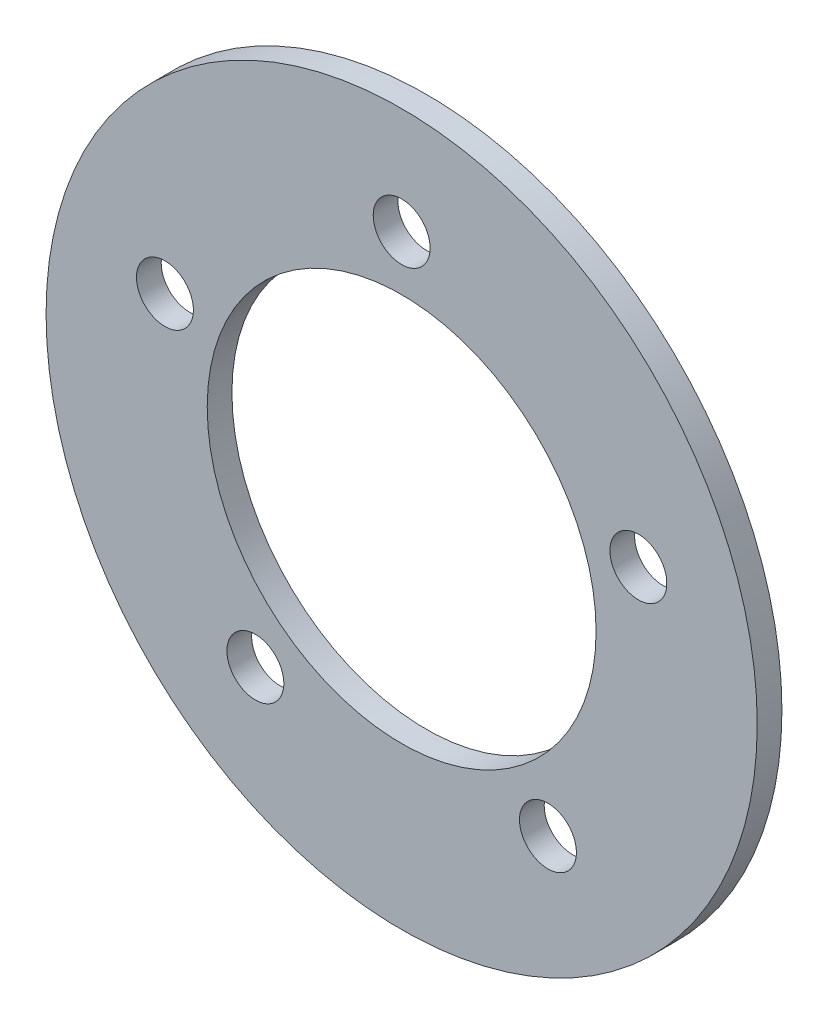
ISO-10303-21;
HEADER;
FILE_DESCRIPTION(('STEP AP214'),'2;1');
FILE_NAME('part.step','',(''),(''),'','','');
FILE_SCHEMA(('AUTOMOTIVE_DESIGN { 1 0 10303 214 1 1 1 1 }'));
ENDSEC;
DATA;
#1=APPLICATION_CONTEXT('core data for automotive mechanical design processes');
#2=APPLICATION_PROTOCOL_DEFINITION('international standard','automotive_design',2000,#1);
#3=PRODUCT_CONTEXT('',#1,'mechanical');
#4=PRODUCT('Part','Part','',(#3));
#5=PRODUCT_RELATED_PRODUCT_CATEGORY('part','',(#4));
#6=PRODUCT_DEFINITION_FORMATION('','',#4);
#7=PRODUCT_DEFINITION_CONTEXT('part definition',#1,'design');
#8=PRODUCT_DEFINITION('design','',#6,#7);
#9=PRODUCT_DEFINITION_SHAPE('','',#8);
#10=(LENGTH_UNIT() NAMED_UNIT(*) SI_UNIT(.MILLI.,.METRE.));
#11=(NAMED_UNIT(*) PLANE_ANGLE_UNIT() SI_UNIT($,.RADIAN.));
#12=(NAMED_UNIT(*) SI_UNIT($,.STERADIAN.) SOLID_ANGLE_UNIT());
#13=UNCERTAINTY_MEASURE_WITH_UNIT(LENGTH_MEASURE(1.E-05),#10,'distance_accuracy_value','');
#14=(GEOMETRIC_REPRESENTATION_CONTEXT(3) GLOBAL_UNCERTAINTY_ASSIGNED_CONTEXT((#13)) GLOBAL_UNIT_ASSIGNED_CONTEXT((#10,
#11,#12)) REPRESENTATION_CONTEXT('',''));
#15=CARTESIAN_POINT('',(0.,0.,0.));
#16=DIRECTION('',(0.,0.,1.));
#17=DIRECTION('',(1.,0.,0.));
#18=AXIS2_PLACEMENT_3D('',#15,#16,#17);
#19=CARTESIAN_POINT('',(0.,0.,-14.2875));
#20=DIRECTION('',(0.,0.,-1.));
#21=DIRECTION('',(-1.,0.,0.));
#22=AXIS2_PLACEMENT_3D('',#19,#20,#21);
#23=PLANE('',#22);
#24=CARTESIAN_POINT('',(15.2169042607224,4.94427190999933,-14.2875));
#25=DIRECTION('',(0.,0.,-1.));
#26=DIRECTION('',(-1.,0.,0.));
#27=AXIS2_PLACEMENT_3D('',#24,#25,#26);
#28=CIRCLE('',#27,1.8288);
#29=CARTESIAN_POINT('',(13.3881042607224,4.94427190999933,-14.2875));
#30=VERTEX_POINT('',#29);
#31=EDGE_CURVE('E86',#30,#30,#28,.T.);
#32=ORIENTED_EDGE('',*,*,#31,.F.);
#33=EDGE_LOOP('',(#32));
#34=FACE_BOUND('',#33,.T.);
#35=CARTESIAN_POINT('',(-9.4045640366795,-12.9442719099992,-14.2875));
#36=DIRECTION('',(0.,0.,-1.));
#37=DIRECTION('',(-1.,0.,0.));
#38=AXIS2_PLACEMENT_3D('',#35,#36,#37);
#39=CIRCLE('',#38,1.8288);
#40=CARTESIAN_POINT('',(-11.2333640366795,-12.9442719099992,-14.2875));
#41=VERTEX_POINT('',#40);
#42=EDGE_CURVE('E70',#41,#41,#39,.T.);
#43=ORIENTED_EDGE('',*,*,#42,.F.);
#44=EDGE_LOOP('',(#43));
#45=FACE_BOUND('',#44,.T.);
#46=CARTESIAN_POINT('',(0.,0.,-14.2875));
#47=DIRECTION('',(0.,0.,-1.));
#48=DIRECTION('',(-1.,0.,0.));
#49=AXIS2_PLACEMENT_3D('',#46,#47,#48);
#50=CIRCLE('',#49,12.5);
#51=CARTESIAN_POINT('',(-12.5,0.,-14.2875));
#52=VERTEX_POINT('',#51);
#53=EDGE_CURVE('E56',#52,#52,#50,.T.);
#54=ORIENTED_EDGE('',*,*,#53,.F.);
#55=EDGE_LOOP('',(#54));
#56=FACE_BOUND('',#55,.T.);
#57=CARTESIAN_POINT('',(0.,0.,-14.2875));
#58=DIRECTION('',(0.,0.,-1.));
#59=DIRECTION('',(-1.,0.,0.));
#60=AXIS2_PLACEMENT_3D('',#57,#58,#59);
#61=CIRCLE('',#60,22.86);
#62=CARTESIAN_POINT('',(-22.86,0.,-14.2875));
#63=VERTEX_POINT('',#62);
#64=EDGE_CURVE('E10',#63,#63,#61,.T.);
#65=ORIENTED_EDGE('',*,*,#64,.T.);
#66=EDGE_LOOP('',(#65));
#67=FACE_BOUND('',#66,.T.);
#68=CARTESIAN_POINT('',(-15.2169042607225,4.94427190999912,-14.2875));
#69=DIRECTION('',(0.,0.,-1.));
#70=DIRECTION('',(-1.,0.,0.));
#71=AXIS2_PLACEMENT_3D('',#68,#69,#70);
#72=CIRCLE('',#71,1.8288);
#73=CARTESIAN_POINT('',(-17.0457042607225,4.94427190999912,-14.2875));
#74=VERTEX_POINT('',#73);
#75=EDGE_CURVE('E62',#74,#74,#72,.T.);
#76=ORIENTED_EDGE('',*,*,#75,.F.);
#77=EDGE_LOOP('',(#76));
#78=FACE_BOUND('',#77,.T.);
#79=CARTESIAN_POINT('',(9.40456403667968,-12.9442719099991,-14.2875));
#80=DIRECTION('',(0.,0.,-1.));
#81=DIRECTION('',(-1.,0.,0.));
#82=AXIS2_PLACEMENT_3D('',#79,#80,#81);
#83=CIRCLE('',#82,1.8288);
#84=CARTESIAN_POINT('',(7.57576403667969,-12.9442719099991,-14.2875));
#85=VERTEX_POINT('',#84);
#86=EDGE_CURVE('E78',#85,#85,#83,.T.);
#87=ORIENTED_EDGE('',*,*,#86,.F.);
#88=EDGE_LOOP('',(#87));
#89=FACE_BOUND('',#88,.T.);
#90=CARTESIAN_POINT('',(0.,16.,-14.2875));
#91=DIRECTION('',(0.,0.,-1.));
#92=DIRECTION('',(-1.,0.,0.));
#93=AXIS2_PLACEMENT_3D('',#90,#91,#92);
#94=CIRCLE('',#93,1.8288);
#95=CARTESIAN_POINT('',(-1.8288,16.,-14.2875));
#96=VERTEX_POINT('',#95);
#97=EDGE_CURVE('E94',#96,#96,#94,.T.);
#98=ORIENTED_EDGE('',*,*,#97,.F.);
#99=EDGE_LOOP('',(#98));
#100=FACE_BOUND('',#99,.T.);
#101=ADVANCED_FACE('F43',(#34,#45,#56,#67,#78,#89,#100),#23,.T.);
#102=CARTESIAN_POINT('',(0.,0.,-12.7));
#103=DIRECTION('',(0.,0.,-1.));
#104=DIRECTION('',(-1.,0.,0.));
#105=AXIS2_PLACEMENT_3D('',#102,#103,#104);
#106=PLANE('',#105);
#107=CARTESIAN_POINT('',(0.,0.,-12.7));
#108=DIRECTION('',(0.,0.,-1.));
#109=DIRECTION('',(-1.,0.,0.));
#110=AXIS2_PLACEMENT_3D('',#107,#108,#109);
#111=CIRCLE('',#110,22.86);
#112=CARTESIAN_POINT('',(-22.86,0.,-12.7));
#113=VERTEX_POINT('',#112);
#114=EDGE_CURVE('E47',#113,#113,#111,.T.);
#115=ORIENTED_EDGE('',*,*,#114,.F.);
#116=EDGE_LOOP('',(#115));
#117=FACE_BOUND('',#116,.T.);
#118=CARTESIAN_POINT('',(0.,0.,-12.7));
#119=DIRECTION('',(0.,0.,-1.));
#120=DIRECTION('',(-1.,0.,0.));
#121=AXIS2_PLACEMENT_3D('',#118,#119,#120);
#122=CIRCLE('',#121,12.5);
#123=CARTESIAN_POINT('',(-12.5,0.,-12.7));
#124=VERTEX_POINT('',#123);
#125=EDGE_CURVE('E58',#124,#124,#122,.T.);
#126=ORIENTED_EDGE('',*,*,#125,.T.);
#127=EDGE_LOOP('',(#126));
#128=FACE_BOUND('',#127,.T.);
#129=CARTESIAN_POINT('',(-15.2169042607225,4.94427190999912,-12.7));
#130=DIRECTION('',(0.,0.,-1.));
#131=DIRECTION('',(-1.,0.,0.));
#132=AXIS2_PLACEMENT_3D('',#129,#130,#131);
#133=CIRCLE('',#132,1.8288);
#134=CARTESIAN_POINT('',(-17.0457042607225,4.94427190999912,-12.7));
#135=VERTEX_POINT('',#134);
#136=EDGE_CURVE('E66',#135,#135,#133,.T.);
#137=ORIENTED_EDGE('',*,*,#136,.T.);
#138=EDGE_LOOP('',(#137));
#139=FACE_BOUND('',#138,.T.);
#140=CARTESIAN_POINT('',(-9.4045640366795,-12.9442719099992,-12.7));
#141=DIRECTION('',(0.,0.,-1.));
#142=DIRECTION('',(-1.,0.,0.));
#143=AXIS2_PLACEMENT_3D('',#140,#141,#142);
#144=CIRCLE('',#143,1.8288);
#145=CARTESIAN_POINT('',(-11.2333640366795,-12.9442719099992,-12.7));
#146=VERTEX_POINT('',#145);
#147=EDGE_CURVE('E74',#146,#146,#144,.T.);
#148=ORIENTED_EDGE('',*,*,#147,.T.);
#149=EDGE_LOOP('',(#148));
#150=FACE_BOUND('',#149,.T.);
#151=CARTESIAN_POINT('',(9.40456403667968,-12.9442719099991,-12.7));
#152=DIRECTION('',(0.,0.,-1.));
#153=DIRECTION('',(-1.,0.,0.));
#154=AXIS2_PLACEMENT_3D('',#151,#152,#153);
#155=CIRCLE('',#154,1.8288);
#156=CARTESIAN_POINT('',(7.57576403667969,-12.9442719099991,-12.7));
#157=VERTEX_POINT('',#156);
#158=EDGE_CURVE('E82',#157,#157,#155,.T.);
#159=ORIENTED_EDGE('',*,*,#158,.T.);
#160=EDGE_LOOP('',(#159));
#161=FACE_BOUND('',#160,.T.);
#162=CARTESIAN_POINT('',(15.2169042607224,4.94427190999933,-12.7));
#163=DIRECTION('',(0.,0.,-1.));
#164=DIRECTION('',(-1.,0.,0.));
#165=AXIS2_PLACEMENT_3D('',#162,#163,#164);
#166=CIRCLE('',#165,1.8288);
#167=CARTESIAN_POINT('',(13.3881042607224,4.94427190999933,-12.7));
#168=VERTEX_POINT('',#167);
#169=EDGE_CURVE('E90',#168,#168,#166,.T.);
#170=ORIENTED_EDGE('',*,*,#169,.T.);
#171=EDGE_LOOP('',(#170));
#172=FACE_BOUND('',#171,.T.);
#173=CARTESIAN_POINT('',(0.,16.,-12.7));
#174=DIRECTION('',(0.,0.,-1.));
#175=DIRECTION('',(-1.,0.,0.));
#176=AXIS2_PLACEMENT_3D('',#173,#174,#175);
#177=CIRCLE('',#176,1.8288);
#178=CARTESIAN_POINT('',(-1.8288,16.,-12.7));
#179=VERTEX_POINT('',#178);
#180=EDGE_CURVE('E98',#179,#179,#177,.T.);
#181=ORIENTED_EDGE('',*,*,#180,.T.);
#182=EDGE_LOOP('',(#181));
#183=FACE_BOUND('',#182,.T.);
#184=ADVANCED_FACE('F110',(#117,#128,#139,#150,#161,#172,#183),#106,.F.);
#185=CARTESIAN_POINT('',(0.,0.,-14.2875));
#186=DIRECTION('',(0.,0.,1.));
#187=DIRECTION('',(1.,0.,0.));
#188=AXIS2_PLACEMENT_3D('',#185,#186,#187);
#189=CYLINDRICAL_SURFACE('',#188,22.86);
#190=ORIENTED_EDGE('',*,*,#64,.F.);
#191=EDGE_LOOP('',(#190));
#192=FACE_BOUND('',#191,.T.);
#193=ORIENTED_EDGE('',*,*,#114,.T.);
#194=EDGE_LOOP('',(#193));
#195=FACE_BOUND('',#194,.T.);
#196=ADVANCED_FACE('F45',(#192,#195),#189,.T.);
#197=CARTESIAN_POINT('',(0.,0.,-14.2875));
#198=DIRECTION('',(0.,0.,1.));
#199=DIRECTION('',(1.,0.,0.));
#200=AXIS2_PLACEMENT_3D('',#197,#198,#199);
#201=CYLINDRICAL_SURFACE('',#200,12.5);
#202=ORIENTED_EDGE('',*,*,#53,.T.);
#203=EDGE_LOOP('',(#202));
#204=FACE_BOUND('',#203,.T.);
#205=ORIENTED_EDGE('',*,*,#125,.F.);
#206=EDGE_LOOP('',(#205));
#207=FACE_BOUND('',#206,.T.);
#208=ADVANCED_FACE('F120',(#204,#207),#201,.F.);
#209=CARTESIAN_POINT('',(-15.2169042607225,4.94427190999912,-14.2875));
#210=DIRECTION('',(0.,0.,1.));
#211=DIRECTION('',(1.,0.,0.));
#212=AXIS2_PLACEMENT_3D('',#209,#210,#211);
#213=CYLINDRICAL_SURFACE('',#212,1.8288);
#214=ORIENTED_EDGE('',*,*,#75,.T.);
#215=EDGE_LOOP('',(#214));
#216=FACE_BOUND('',#215,.T.);
#217=ORIENTED_EDGE('',*,*,#136,.F.);
#218=EDGE_LOOP('',(#217));
#219=FACE_BOUND('',#218,.T.);
#220=ADVANCED_FACE('F123',(#216,#219),#213,.F.);
#221=CARTESIAN_POINT('',(-9.4045640366795,-12.9442719099992,-14.2875));
#222=DIRECTION('',(0.,0.,1.));
#223=DIRECTION('',(1.,0.,0.));
#224=AXIS2_PLACEMENT_3D('',#221,#222,#223);
#225=CYLINDRICAL_SURFACE('',#224,1.8288);
#226=ORIENTED_EDGE('',*,*,#42,.T.);
#227=EDGE_LOOP('',(#226));
#228=FACE_BOUND('',#227,.T.);
#229=ORIENTED_EDGE('',*,*,#147,.F.);
#230=EDGE_LOOP('',(#229));
#231=FACE_BOUND('',#230,.T.);
#232=ADVANCED_FACE('F127',(#228,#231),#225,.F.);
#233=CARTESIAN_POINT('',(9.40456403667968,-12.9442719099991,-14.2875));
#234=DIRECTION('',(0.,0.,1.));
#235=DIRECTION('',(1.,0.,0.));
#236=AXIS2_PLACEMENT_3D('',#233,#234,#235);
#237=CYLINDRICAL_SURFACE('',#236,1.8288);
#238=ORIENTED_EDGE('',*,*,#86,.T.);
#239=EDGE_LOOP('',(#238));
#240=FACE_BOUND('',#239,.T.);
#241=ORIENTED_EDGE('',*,*,#158,.F.);
#242=EDGE_LOOP('',(#241));
#243=FACE_BOUND('',#242,.T.);
#244=ADVANCED_FACE('F131',(#240,#243),#237,.F.);
#245=CARTESIAN_POINT('',(15.2169042607224,4.94427190999933,-14.2875));
#246=DIRECTION('',(0.,0.,1.));
#247=DIRECTION('',(1.,0.,0.));
#248=AXIS2_PLACEMENT_3D('',#245,#246,#247);
#249=CYLINDRICAL_SURFACE('',#248,1.8288);
#250=ORIENTED_EDGE('',*,*,#31,.T.);
#251=EDGE_LOOP('',(#250));
#252=FACE_BOUND('',#251,.T.);
#253=ORIENTED_EDGE('',*,*,#169,.F.);
#254=EDGE_LOOP('',(#253));
#255=FACE_BOUND('',#254,.T.);
#256=ADVANCED_FACE('F135',(#252,#255),#249,.F.);
#257=CARTESIAN_POINT('',(0.,16.,-14.2875));
#258=DIRECTION('',(0.,0.,1.));
#259=DIRECTION('',(1.,0.,0.));
#260=AXIS2_PLACEMENT_3D('',#257,#258,#259);
#261=CYLINDRICAL_SURFACE('',#260,1.8288);
#262=ORIENTED_EDGE('',*,*,#97,.T.);
#263=EDGE_LOOP('',(#262));
#264=FACE_BOUND('',#263,.T.);
#265=ORIENTED_EDGE('',*,*,#180,.F.);
#266=EDGE_LOOP('',(#265));
#267=FACE_BOUND('',#266,.T.);
#268=ADVANCED_FACE('F106',(#264,#267),#261,.F.);
#269=CLOSED_SHELL('',(#101,#184,#196,#208,#220,#232,#244,#256,#268));
#270=MANIFOLD_SOLID_BREP('B2',#269);
#271=ADVANCED_BREP_SHAPE_REPRESENTATION('',(#18,#270),#14);
#272=SHAPE_DEFINITION_REPRESENTATION(#9,#271);
ENDSEC;
END-ISO-10303-21;
